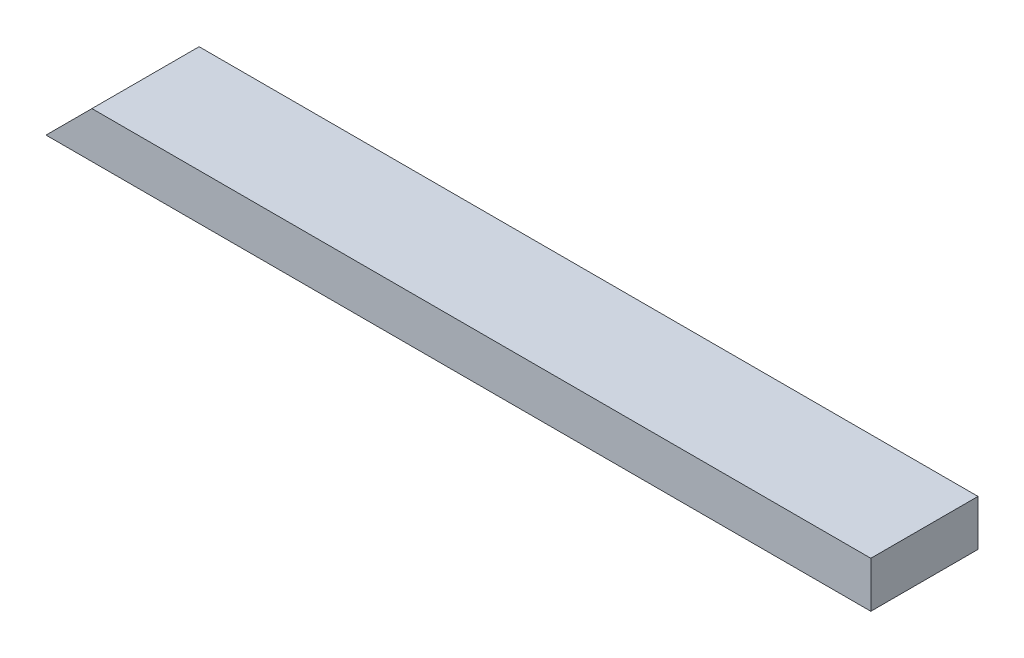
ISO-10303-21;
HEADER;
FILE_DESCRIPTION(('STEP AP214'),'2;1');
FILE_NAME('part.step','',(''),(''),'','','');
FILE_SCHEMA(('AUTOMOTIVE_DESIGN { 1 0 10303 214 1 1 1 1 }'));
ENDSEC;
DATA;
#1=APPLICATION_CONTEXT('core data for automotive mechanical design processes');
#2=APPLICATION_PROTOCOL_DEFINITION('international standard','automotive_design',2000,#1);
#3=PRODUCT_CONTEXT('',#1,'mechanical');
#4=PRODUCT('Part','Part','',(#3));
#5=PRODUCT_RELATED_PRODUCT_CATEGORY('part','',(#4));
#6=PRODUCT_DEFINITION_FORMATION('','',#4);
#7=PRODUCT_DEFINITION_CONTEXT('part definition',#1,'design');
#8=PRODUCT_DEFINITION('design','',#6,#7);
#9=PRODUCT_DEFINITION_SHAPE('','',#8);
#10=(LENGTH_UNIT() NAMED_UNIT(*) SI_UNIT(.MILLI.,.METRE.));
#11=(NAMED_UNIT(*) PLANE_ANGLE_UNIT() SI_UNIT($,.RADIAN.));
#12=(NAMED_UNIT(*) SI_UNIT($,.STERADIAN.) SOLID_ANGLE_UNIT());
#13=UNCERTAINTY_MEASURE_WITH_UNIT(LENGTH_MEASURE(1.E-05),#10,'distance_accuracy_value','');
#14=(GEOMETRIC_REPRESENTATION_CONTEXT(3) GLOBAL_UNCERTAINTY_ASSIGNED_CONTEXT((#13)) GLOBAL_UNIT_ASSIGNED_CONTEXT((#10,
#11,#12)) REPRESENTATION_CONTEXT('',''));
#15=CARTESIAN_POINT('',(0.,0.,0.));
#16=DIRECTION('',(0.,0.,1.));
#17=DIRECTION('',(1.,0.,0.));
#18=AXIS2_PLACEMENT_3D('',#15,#16,#17);
#19=CARTESIAN_POINT('',(0.,38.1,0.));
#20=DIRECTION('',(0.,0.,-1.));
#21=DIRECTION('',(-1.,0.,0.));
#22=AXIS2_PLACEMENT_3D('',#19,#20,#21);
#23=PLANE('',#22);
#24=DIRECTION('',(1.,0.,0.));
#25=VECTOR('',#24,1.);
#26=CARTESIAN_POINT('',(0.,38.1,0.));
#27=LINE('',#26,#25);
#28=CARTESIAN_POINT('',(38.1,38.1,0.));
#29=VERTEX_POINT('',#28);
#30=CARTESIAN_POINT('',(684.2125,38.1,0.));
#31=VERTEX_POINT('',#30);
#32=EDGE_CURVE('E92',#29,#31,#27,.T.);
#33=ORIENTED_EDGE('',*,*,#32,.F.);
#34=DIRECTION('',(0.707106781186547,0.707106781186547,0.));
#35=VECTOR('',#34,1.);
#36=CARTESIAN_POINT('',(0.,0.,0.));
#37=LINE('',#36,#35);
#38=CARTESIAN_POINT('',(0.,0.,0.));
#39=VERTEX_POINT('',#38);
#40=EDGE_CURVE('E86',#39,#29,#37,.T.);
#41=ORIENTED_EDGE('',*,*,#40,.F.);
#42=DIRECTION('',(1.,0.,0.));
#43=VECTOR('',#42,1.);
#44=CARTESIAN_POINT('',(0.,0.,0.));
#45=LINE('',#44,#43);
#46=CARTESIAN_POINT('',(684.2125,0.,0.));
#47=VERTEX_POINT('',#46);
#48=EDGE_CURVE('E96',#39,#47,#45,.T.);
#49=ORIENTED_EDGE('',*,*,#48,.T.);
#50=DIRECTION('',(0.,-1.,0.));
#51=VECTOR('',#50,1.);
#52=CARTESIAN_POINT('',(684.2125,38.1,0.));
#53=LINE('',#52,#51);
#54=EDGE_CURVE('E11',#31,#47,#53,.T.);
#55=ORIENTED_EDGE('',*,*,#54,.F.);
#56=EDGE_LOOP('',(#33,#41,#49,#55));
#57=FACE_BOUND('',#56,.T.);
#58=ADVANCED_FACE('F39',(#57),#23,.F.);
#59=CARTESIAN_POINT('',(684.2125,38.1,0.));
#60=DIRECTION('',(-1.,0.,0.));
#61=DIRECTION('',(0.,0.,1.));
#62=AXIS2_PLACEMENT_3D('',#59,#60,#61);
#63=PLANE('',#62);
#64=DIRECTION('',(0.,0.,-1.));
#65=VECTOR('',#64,1.);
#66=CARTESIAN_POINT('',(684.2125,0.,0.));
#67=LINE('',#66,#65);
#68=CARTESIAN_POINT('',(684.2125,0.,-88.9));
#69=VERTEX_POINT('',#68);
#70=EDGE_CURVE('E67',#47,#69,#67,.T.);
#71=ORIENTED_EDGE('',*,*,#70,.T.);
#72=DIRECTION('',(0.,-1.,0.));
#73=VECTOR('',#72,1.);
#74=CARTESIAN_POINT('',(684.2125,38.1,-88.9));
#75=LINE('',#74,#73);
#76=CARTESIAN_POINT('',(684.2125,38.1,-88.9));
#77=VERTEX_POINT('',#76);
#78=EDGE_CURVE('E47',#77,#69,#75,.T.);
#79=ORIENTED_EDGE('',*,*,#78,.F.);
#80=DIRECTION('',(0.,0.,-1.));
#81=VECTOR('',#80,1.);
#82=CARTESIAN_POINT('',(684.2125,38.1,0.));
#83=LINE('',#82,#81);
#84=EDGE_CURVE('E55',#31,#77,#83,.T.);
#85=ORIENTED_EDGE('',*,*,#84,.F.);
#86=ORIENTED_EDGE('',*,*,#54,.T.);
#87=EDGE_LOOP('',(#71,#79,#85,#86));
#88=FACE_BOUND('',#87,.T.);
#89=ADVANCED_FACE('F111',(#88),#63,.F.);
#90=CARTESIAN_POINT('',(0.,38.1,-88.9));
#91=DIRECTION('',(0.,0.,1.));
#92=DIRECTION('',(1.,0.,0.));
#93=AXIS2_PLACEMENT_3D('',#90,#91,#92);
#94=PLANE('',#93);
#95=DIRECTION('',(-1.,0.,0.));
#96=VECTOR('',#95,1.);
#97=CARTESIAN_POINT('',(0.,0.,-88.9));
#98=LINE('',#97,#96);
#99=CARTESIAN_POINT('',(0.,0.,-88.9));
#100=VERTEX_POINT('',#99);
#101=EDGE_CURVE('E89',#69,#100,#98,.T.);
#102=ORIENTED_EDGE('',*,*,#101,.T.);
#103=DIRECTION('',(0.707106781186547,0.707106781186547,0.));
#104=VECTOR('',#103,1.);
#105=CARTESIAN_POINT('',(0.,0.,-88.9));
#106=LINE('',#105,#104);
#107=CARTESIAN_POINT('',(38.1,38.1,-88.9));
#108=VERTEX_POINT('',#107);
#109=EDGE_CURVE('E74',#100,#108,#106,.T.);
#110=ORIENTED_EDGE('',*,*,#109,.T.);
#111=DIRECTION('',(-1.,0.,0.));
#112=VECTOR('',#111,1.);
#113=CARTESIAN_POINT('',(0.,38.1,-88.9));
#114=LINE('',#113,#112);
#115=EDGE_CURVE('E101',#77,#108,#114,.T.);
#116=ORIENTED_EDGE('',*,*,#115,.F.);
#117=ORIENTED_EDGE('',*,*,#78,.T.);
#118=EDGE_LOOP('',(#102,#110,#116,#117));
#119=FACE_BOUND('',#118,.T.);
#120=ADVANCED_FACE('F90',(#119),#94,.F.);
#121=CARTESIAN_POINT('',(0.,38.1,0.));
#122=DIRECTION('',(0.,-1.,0.));
#123=DIRECTION('',(0.,0.,-1.));
#124=AXIS2_PLACEMENT_3D('',#121,#122,#123);
#125=PLANE('',#124);
#126=ORIENTED_EDGE('',*,*,#115,.T.);
#127=DIRECTION('',(0.,0.,1.));
#128=VECTOR('',#127,1.);
#129=CARTESIAN_POINT('',(38.1,38.1,-88.9));
#130=LINE('',#129,#128);
#131=EDGE_CURVE('E83',#108,#29,#130,.T.);
#132=ORIENTED_EDGE('',*,*,#131,.T.);
#133=ORIENTED_EDGE('',*,*,#32,.T.);
#134=ORIENTED_EDGE('',*,*,#84,.T.);
#135=EDGE_LOOP('',(#126,#132,#133,#134));
#136=FACE_BOUND('',#135,.T.);
#137=ADVANCED_FACE('F109',(#136),#125,.F.);
#138=CARTESIAN_POINT('',(0.,0.,0.));
#139=DIRECTION('',(0.,-1.,0.));
#140=DIRECTION('',(0.,0.,-1.));
#141=AXIS2_PLACEMENT_3D('',#138,#139,#140);
#142=PLANE('',#141);
#143=DIRECTION('',(0.,0.,1.));
#144=VECTOR('',#143,1.);
#145=CARTESIAN_POINT('',(0.,0.,0.));
#146=LINE('',#145,#144);
#147=EDGE_CURVE('E80',#100,#39,#146,.T.);
#148=ORIENTED_EDGE('',*,*,#147,.F.);
#149=ORIENTED_EDGE('',*,*,#101,.F.);
#150=ORIENTED_EDGE('',*,*,#70,.F.);
#151=ORIENTED_EDGE('',*,*,#48,.F.);
#152=EDGE_LOOP('',(#148,#149,#150,#151));
#153=FACE_BOUND('',#152,.T.);
#154=ADVANCED_FACE('F95',(#153),#142,.T.);
#155=CARTESIAN_POINT('',(0.,0.,-88.9));
#156=DIRECTION('',(0.707106781186547,-0.707106781186547,0.));
#157=DIRECTION('',(0.707106781186548,0.707106781186548,0.));
#158=AXIS2_PLACEMENT_3D('',#155,#156,#157);
#159=PLANE('',#158);
#160=ORIENTED_EDGE('',*,*,#40,.T.);
#161=ORIENTED_EDGE('',*,*,#131,.F.);
#162=ORIENTED_EDGE('',*,*,#109,.F.);
#163=ORIENTED_EDGE('',*,*,#147,.T.);
#164=EDGE_LOOP('',(#160,#161,#162,#163));
#165=FACE_BOUND('',#164,.T.);
#166=ADVANCED_FACE('F77',(#165),#159,.F.);
#167=CLOSED_SHELL('',(#58,#89,#120,#137,#154,#166));
#168=MANIFOLD_SOLID_BREP('B2',#167);
#169=ADVANCED_BREP_SHAPE_REPRESENTATION('',(#18,#168),#14);
#170=SHAPE_DEFINITION_REPRESENTATION(#9,#169);
ENDSEC;
END-ISO-10303-21;
